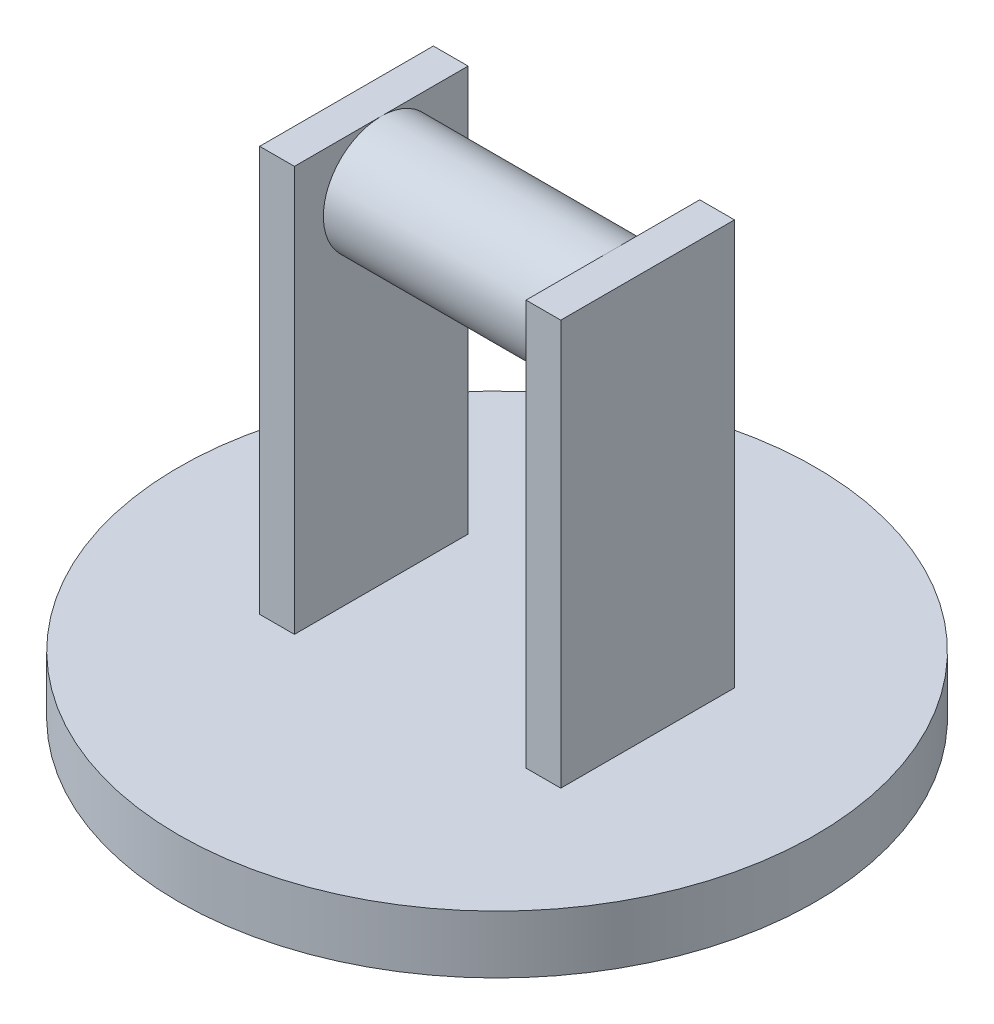
ISO-10303-21;
HEADER;
FILE_DESCRIPTION(('STEP AP214'),'2;1');
FILE_NAME('part.step','',(''),(''),'','','');
FILE_SCHEMA(('AUTOMOTIVE_DESIGN { 1 0 10303 214 1 1 1 1 }'));
ENDSEC;
DATA;
#1=APPLICATION_CONTEXT('core data for automotive mechanical design processes');
#2=APPLICATION_PROTOCOL_DEFINITION('international standard','automotive_design',2000,#1);
#3=PRODUCT_CONTEXT('',#1,'mechanical');
#4=PRODUCT('Part','Part','',(#3));
#5=PRODUCT_RELATED_PRODUCT_CATEGORY('part','',(#4));
#6=PRODUCT_DEFINITION_FORMATION('','',#4);
#7=PRODUCT_DEFINITION_CONTEXT('part definition',#1,'design');
#8=PRODUCT_DEFINITION('design','',#6,#7);
#9=PRODUCT_DEFINITION_SHAPE('','',#8);
#10=(LENGTH_UNIT() NAMED_UNIT(*) SI_UNIT(.MILLI.,.METRE.));
#11=(NAMED_UNIT(*) PLANE_ANGLE_UNIT() SI_UNIT($,.RADIAN.));
#12=(NAMED_UNIT(*) SI_UNIT($,.STERADIAN.) SOLID_ANGLE_UNIT());
#13=UNCERTAINTY_MEASURE_WITH_UNIT(LENGTH_MEASURE(1.E-05),#10,'distance_accuracy_value','');
#14=(GEOMETRIC_REPRESENTATION_CONTEXT(3) GLOBAL_UNCERTAINTY_ASSIGNED_CONTEXT((#13)) GLOBAL_UNIT_ASSIGNED_CONTEXT((#10,
#11,#12)) REPRESENTATION_CONTEXT('',''));
#15=CARTESIAN_POINT('',(0.,0.,0.));
#16=DIRECTION('',(0.,0.,1.));
#17=DIRECTION('',(1.,0.,0.));
#18=AXIS2_PLACEMENT_3D('',#15,#16,#17);
#19=CARTESIAN_POINT('',(0.,6.35,0.));
#20=DIRECTION('',(0.,1.,0.));
#21=DIRECTION('',(0.,0.,1.));
#22=AXIS2_PLACEMENT_3D('',#19,#20,#21);
#23=PLANE('',#22);
#24=DIRECTION('',(0.,0.,1.));
#25=VECTOR('',#24,1.);
#26=CARTESIAN_POINT('',(16.51,6.35,0.));
#27=LINE('',#26,#25);
#28=CARTESIAN_POINT('',(16.51,6.35,-9.525));
#29=VERTEX_POINT('',#28);
#30=CARTESIAN_POINT('',(16.51,6.35,9.525));
#31=VERTEX_POINT('',#30);
#32=EDGE_CURVE('E210',#29,#31,#27,.T.);
#33=ORIENTED_EDGE('',*,*,#32,.T.);
#34=DIRECTION('',(1.,0.,0.));
#35=VECTOR('',#34,1.);
#36=CARTESIAN_POINT('',(0.,6.35,9.525));
#37=LINE('',#36,#35);
#38=CARTESIAN_POINT('',(12.7,6.35,9.525));
#39=VERTEX_POINT('',#38);
#40=EDGE_CURVE('E217',#39,#31,#37,.T.);
#41=ORIENTED_EDGE('',*,*,#40,.F.);
#42=DIRECTION('',(0.,0.,-1.));
#43=VECTOR('',#42,1.);
#44=CARTESIAN_POINT('',(12.7,6.35,0.));
#45=LINE('',#44,#43);
#46=CARTESIAN_POINT('',(12.7,6.35,-9.525));
#47=VERTEX_POINT('',#46);
#48=EDGE_CURVE('E59',#39,#47,#45,.T.);
#49=ORIENTED_EDGE('',*,*,#48,.T.);
#50=DIRECTION('',(1.,0.,0.));
#51=VECTOR('',#50,1.);
#52=CARTESIAN_POINT('',(0.,6.35,-9.525));
#53=LINE('',#52,#51);
#54=EDGE_CURVE('E228',#47,#29,#53,.T.);
#55=ORIENTED_EDGE('',*,*,#54,.T.);
#56=EDGE_LOOP('',(#33,#41,#49,#55));
#57=FACE_BOUND('',#56,.T.);
#58=CARTESIAN_POINT('',(0.,6.35,0.));
#59=DIRECTION('',(0.,1.,0.));
#60=DIRECTION('',(0.,0.,1.));
#61=AXIS2_PLACEMENT_3D('',#58,#59,#60);
#62=CIRCLE('',#61,34.925);
#63=CARTESIAN_POINT('',(0.,6.35,34.925));
#64=VERTEX_POINT('',#63);
#65=EDGE_CURVE('E11',#64,#64,#62,.T.);
#66=ORIENTED_EDGE('',*,*,#65,.T.);
#67=EDGE_LOOP('',(#66));
#68=FACE_BOUND('',#67,.T.);
#69=DIRECTION('',(0.,0.,1.));
#70=VECTOR('',#69,1.);
#71=CARTESIAN_POINT('',(-16.51,6.35,0.));
#72=LINE('',#71,#70);
#73=CARTESIAN_POINT('',(-16.51,6.35,-9.525));
#74=VERTEX_POINT('',#73);
#75=CARTESIAN_POINT('',(-16.51,6.35,9.525));
#76=VERTEX_POINT('',#75);
#77=EDGE_CURVE('E134',#74,#76,#72,.T.);
#78=ORIENTED_EDGE('',*,*,#77,.F.);
#79=DIRECTION('',(-1.,0.,0.));
#80=VECTOR('',#79,1.);
#81=CARTESIAN_POINT('',(0.,6.35,-9.525));
#82=LINE('',#81,#80);
#83=CARTESIAN_POINT('',(-12.7,6.35,-9.525));
#84=VERTEX_POINT('',#83);
#85=EDGE_CURVE('E131',#84,#74,#82,.T.);
#86=ORIENTED_EDGE('',*,*,#85,.F.);
#87=DIRECTION('',(0.,0.,-1.));
#88=VECTOR('',#87,1.);
#89=CARTESIAN_POINT('',(-12.7,6.35,0.));
#90=LINE('',#89,#88);
#91=CARTESIAN_POINT('',(-12.7,6.35,9.525));
#92=VERTEX_POINT('',#91);
#93=EDGE_CURVE('E141',#92,#84,#90,.T.);
#94=ORIENTED_EDGE('',*,*,#93,.F.);
#95=DIRECTION('',(-1.,0.,0.));
#96=VECTOR('',#95,1.);
#97=CARTESIAN_POINT('',(0.,6.35,9.525));
#98=LINE('',#97,#96);
#99=EDGE_CURVE('E138',#92,#76,#98,.T.);
#100=ORIENTED_EDGE('',*,*,#99,.T.);
#101=EDGE_LOOP('',(#78,#86,#94,#100));
#102=FACE_BOUND('',#101,.T.);
#103=ADVANCED_FACE('F39',(#57,#68,#102),#23,.T.);
#104=CARTESIAN_POINT('',(0.,6.35,0.));
#105=DIRECTION('',(0.,-1.,0.));
#106=DIRECTION('',(0.,0.,-1.));
#107=AXIS2_PLACEMENT_3D('',#104,#105,#106);
#108=CYLINDRICAL_SURFACE('',#107,34.925);
#109=ORIENTED_EDGE('',*,*,#65,.F.);
#110=EDGE_LOOP('',(#109));
#111=FACE_BOUND('',#110,.T.);
#112=CARTESIAN_POINT('',(0.,0.,0.));
#113=DIRECTION('',(0.,1.,0.));
#114=DIRECTION('',(0.,0.,1.));
#115=AXIS2_PLACEMENT_3D('',#112,#113,#114);
#116=CIRCLE('',#115,34.925);
#117=CARTESIAN_POINT('',(0.,0.,34.925));
#118=VERTEX_POINT('',#117);
#119=EDGE_CURVE('E43',#118,#118,#116,.T.);
#120=ORIENTED_EDGE('',*,*,#119,.T.);
#121=EDGE_LOOP('',(#120));
#122=FACE_BOUND('',#121,.T.);
#123=ADVANCED_FACE('F41',(#111,#122),#108,.T.);
#124=CARTESIAN_POINT('',(0.,0.,0.));
#125=DIRECTION('',(0.,1.,0.));
#126=DIRECTION('',(0.,0.,1.));
#127=AXIS2_PLACEMENT_3D('',#124,#125,#126);
#128=PLANE('',#127);
#129=ORIENTED_EDGE('',*,*,#119,.F.);
#130=EDGE_LOOP('',(#129));
#131=FACE_BOUND('',#130,.T.);
#132=ADVANCED_FACE('F156',(#131),#128,.F.);
#133=CARTESIAN_POINT('',(0.,50.8,-9.525));
#134=DIRECTION('',(0.,0.,1.));
#135=DIRECTION('',(1.,0.,0.));
#136=AXIS2_PLACEMENT_3D('',#133,#134,#135);
#137=PLANE('',#136);
#138=ORIENTED_EDGE('',*,*,#85,.T.);
#139=DIRECTION('',(0.,-1.,0.));
#140=VECTOR('',#139,1.);
#141=CARTESIAN_POINT('',(-16.51,50.8,-9.525));
#142=LINE('',#141,#140);
#143=CARTESIAN_POINT('',(-16.51,50.8,-9.525));
#144=VERTEX_POINT('',#143);
#145=EDGE_CURVE('E149',#144,#74,#142,.T.);
#146=ORIENTED_EDGE('',*,*,#145,.F.);
#147=DIRECTION('',(-1.,0.,0.));
#148=VECTOR('',#147,1.);
#149=CARTESIAN_POINT('',(0.,50.8,-9.525));
#150=LINE('',#149,#148);
#151=CARTESIAN_POINT('',(-12.7,50.8,-9.525));
#152=VERTEX_POINT('',#151);
#153=EDGE_CURVE('E143',#152,#144,#150,.T.);
#154=ORIENTED_EDGE('',*,*,#153,.F.);
#155=DIRECTION('',(0.,-1.,0.));
#156=VECTOR('',#155,1.);
#157=CARTESIAN_POINT('',(-12.7,50.8,-9.525));
#158=LINE('',#157,#156);
#159=EDGE_CURVE('E120',#152,#84,#158,.T.);
#160=ORIENTED_EDGE('',*,*,#159,.T.);
#161=EDGE_LOOP('',(#138,#146,#154,#160));
#162=FACE_BOUND('',#161,.T.);
#163=ADVANCED_FACE('F158',(#162),#137,.F.);
#164=CARTESIAN_POINT('',(-16.51,50.8,0.));
#165=DIRECTION('',(1.,0.,0.));
#166=DIRECTION('',(0.,0.,-1.));
#167=AXIS2_PLACEMENT_3D('',#164,#165,#166);
#168=PLANE('',#167);
#169=ORIENTED_EDGE('',*,*,#77,.T.);
#170=DIRECTION('',(0.,-1.,0.));
#171=VECTOR('',#170,1.);
#172=CARTESIAN_POINT('',(-16.51,50.8,9.525));
#173=LINE('',#172,#171);
#174=CARTESIAN_POINT('',(-16.51,50.8,9.525));
#175=VERTEX_POINT('',#174);
#176=EDGE_CURVE('E147',#175,#76,#173,.T.);
#177=ORIENTED_EDGE('',*,*,#176,.F.);
#178=DIRECTION('',(0.,0.,1.));
#179=VECTOR('',#178,1.);
#180=CARTESIAN_POINT('',(-16.51,50.8,0.));
#181=LINE('',#180,#179);
#182=EDGE_CURVE('E127',#144,#175,#181,.T.);
#183=ORIENTED_EDGE('',*,*,#182,.F.);
#184=ORIENTED_EDGE('',*,*,#145,.T.);
#185=EDGE_LOOP('',(#169,#177,#183,#184));
#186=FACE_BOUND('',#185,.T.);
#187=ADVANCED_FACE('F163',(#186),#168,.F.);
#188=CARTESIAN_POINT('',(0.,50.8,9.525));
#189=DIRECTION('',(0.,0.,1.));
#190=DIRECTION('',(1.,0.,0.));
#191=AXIS2_PLACEMENT_3D('',#188,#189,#190);
#192=PLANE('',#191);
#193=ORIENTED_EDGE('',*,*,#99,.F.);
#194=DIRECTION('',(0.,-1.,0.));
#195=VECTOR('',#194,1.);
#196=CARTESIAN_POINT('',(-12.7,50.8,9.525));
#197=LINE('',#196,#195);
#198=CARTESIAN_POINT('',(-12.7,50.8,9.525));
#199=VERTEX_POINT('',#198);
#200=EDGE_CURVE('E145',#199,#92,#197,.T.);
#201=ORIENTED_EDGE('',*,*,#200,.F.);
#202=DIRECTION('',(-1.,0.,0.));
#203=VECTOR('',#202,1.);
#204=CARTESIAN_POINT('',(0.,50.8,9.525));
#205=LINE('',#204,#203);
#206=EDGE_CURVE('E116',#199,#175,#205,.T.);
#207=ORIENTED_EDGE('',*,*,#206,.T.);
#208=ORIENTED_EDGE('',*,*,#176,.T.);
#209=EDGE_LOOP('',(#193,#201,#207,#208));
#210=FACE_BOUND('',#209,.T.);
#211=ADVANCED_FACE('F177',(#210),#192,.T.);
#212=CARTESIAN_POINT('',(-12.7,50.8,0.));
#213=DIRECTION('',(-1.,0.,0.));
#214=DIRECTION('',(0.,0.,1.));
#215=AXIS2_PLACEMENT_3D('',#212,#213,#214);
#216=PLANE('',#215);
#217=DIRECTION('',(0.,0.,-1.));
#218=VECTOR('',#217,1.);
#219=CARTESIAN_POINT('',(-12.7,50.8,0.));
#220=LINE('',#219,#218);
#221=CARTESIAN_POINT('',(-12.7,50.8,0.));
#222=VERTEX_POINT('',#221);
#223=EDGE_CURVE('E113',#222,#152,#220,.T.);
#224=ORIENTED_EDGE('',*,*,#223,.F.);
#225=CARTESIAN_POINT('',(-12.7,44.45,0.));
#226=DIRECTION('',(1.,0.,0.));
#227=DIRECTION('',(0.,0.,-1.));
#228=AXIS2_PLACEMENT_3D('',#225,#226,#227);
#229=CIRCLE('',#228,6.35);
#230=EDGE_CURVE('E124',#222,#222,#229,.T.);
#231=ORIENTED_EDGE('',*,*,#230,.F.);
#232=EDGE_CURVE('E109',#199,#222,#220,.T.);
#233=ORIENTED_EDGE('',*,*,#232,.F.);
#234=ORIENTED_EDGE('',*,*,#200,.T.);
#235=ORIENTED_EDGE('',*,*,#93,.T.);
#236=ORIENTED_EDGE('',*,*,#159,.F.);
#237=EDGE_LOOP('',(#224,#231,#233,#234,#235,#236));
#238=FACE_BOUND('',#237,.T.);
#239=ADVANCED_FACE('F122',(#238),#216,.F.);
#240=CARTESIAN_POINT('',(0.,50.8,0.));
#241=DIRECTION('',(0.,1.,0.));
#242=DIRECTION('',(0.,0.,1.));
#243=AXIS2_PLACEMENT_3D('',#240,#241,#242);
#244=PLANE('',#243);
#245=ORIENTED_EDGE('',*,*,#153,.T.);
#246=ORIENTED_EDGE('',*,*,#182,.T.);
#247=ORIENTED_EDGE('',*,*,#206,.F.);
#248=ORIENTED_EDGE('',*,*,#232,.T.);
#249=ORIENTED_EDGE('',*,*,#223,.T.);
#250=EDGE_LOOP('',(#245,#246,#247,#248,#249));
#251=FACE_BOUND('',#250,.T.);
#252=ADVANCED_FACE('F112',(#251),#244,.T.);
#253=CARTESIAN_POINT('',(16.51,50.8,0.));
#254=DIRECTION('',(1.,0.,0.));
#255=DIRECTION('',(0.,0.,-1.));
#256=AXIS2_PLACEMENT_3D('',#253,#254,#255);
#257=PLANE('',#256);
#258=ORIENTED_EDGE('',*,*,#32,.F.);
#259=DIRECTION('',(0.,-1.,0.));
#260=VECTOR('',#259,1.);
#261=CARTESIAN_POINT('',(16.51,50.8,-9.525));
#262=LINE('',#261,#260);
#263=CARTESIAN_POINT('',(16.51,50.8,-9.525));
#264=VERTEX_POINT('',#263);
#265=EDGE_CURVE('E135',#264,#29,#262,.T.);
#266=ORIENTED_EDGE('',*,*,#265,.F.);
#267=DIRECTION('',(0.,0.,1.));
#268=VECTOR('',#267,1.);
#269=CARTESIAN_POINT('',(16.51,50.8,0.));
#270=LINE('',#269,#268);
#271=CARTESIAN_POINT('',(16.51,50.8,9.525));
#272=VERTEX_POINT('',#271);
#273=EDGE_CURVE('E213',#264,#272,#270,.T.);
#274=ORIENTED_EDGE('',*,*,#273,.T.);
#275=DIRECTION('',(0.,-1.,0.));
#276=VECTOR('',#275,1.);
#277=CARTESIAN_POINT('',(16.51,50.8,9.525));
#278=LINE('',#277,#276);
#279=EDGE_CURVE('E226',#272,#31,#278,.T.);
#280=ORIENTED_EDGE('',*,*,#279,.T.);
#281=EDGE_LOOP('',(#258,#266,#274,#280));
#282=FACE_BOUND('',#281,.T.);
#283=ADVANCED_FACE('F185',(#282),#257,.T.);
#284=CARTESIAN_POINT('',(0.,50.8,-9.525));
#285=DIRECTION('',(0.,0.,-1.));
#286=DIRECTION('',(-1.,0.,0.));
#287=AXIS2_PLACEMENT_3D('',#284,#285,#286);
#288=PLANE('',#287);
#289=ORIENTED_EDGE('',*,*,#54,.F.);
#290=DIRECTION('',(0.,-1.,0.));
#291=VECTOR('',#290,1.);
#292=CARTESIAN_POINT('',(12.7,50.8,-9.525));
#293=LINE('',#292,#291);
#294=CARTESIAN_POINT('',(12.7,50.8,-9.525));
#295=VERTEX_POINT('',#294);
#296=EDGE_CURVE('E237',#295,#47,#293,.T.);
#297=ORIENTED_EDGE('',*,*,#296,.F.);
#298=DIRECTION('',(1.,0.,0.));
#299=VECTOR('',#298,1.);
#300=CARTESIAN_POINT('',(0.,50.8,-9.525));
#301=LINE('',#300,#299);
#302=EDGE_CURVE('E216',#295,#264,#301,.T.);
#303=ORIENTED_EDGE('',*,*,#302,.T.);
#304=ORIENTED_EDGE('',*,*,#265,.T.);
#305=EDGE_LOOP('',(#289,#297,#303,#304));
#306=FACE_BOUND('',#305,.T.);
#307=ADVANCED_FACE('F188',(#306),#288,.T.);
#308=CARTESIAN_POINT('',(12.7,50.8,0.));
#309=DIRECTION('',(-1.,0.,0.));
#310=DIRECTION('',(0.,0.,1.));
#311=AXIS2_PLACEMENT_3D('',#308,#309,#310);
#312=PLANE('',#311);
#313=DIRECTION('',(0.,0.,-1.));
#314=VECTOR('',#313,1.);
#315=CARTESIAN_POINT('',(12.7,50.8,0.));
#316=LINE('',#315,#314);
#317=CARTESIAN_POINT('',(12.7,50.8,9.525));
#318=VERTEX_POINT('',#317);
#319=CARTESIAN_POINT('',(12.7,50.8,0.));
#320=VERTEX_POINT('',#319);
#321=EDGE_CURVE('E221',#318,#320,#316,.T.);
#322=ORIENTED_EDGE('',*,*,#321,.T.);
#323=CARTESIAN_POINT('',(12.7,44.45,0.));
#324=DIRECTION('',(-1.,0.,0.));
#325=DIRECTION('',(0.,0.,1.));
#326=AXIS2_PLACEMENT_3D('',#323,#324,#325);
#327=CIRCLE('',#326,6.35);
#328=EDGE_CURVE('E52',#320,#320,#327,.T.);
#329=ORIENTED_EDGE('',*,*,#328,.F.);
#330=EDGE_CURVE('E220',#320,#295,#316,.T.);
#331=ORIENTED_EDGE('',*,*,#330,.T.);
#332=ORIENTED_EDGE('',*,*,#296,.T.);
#333=ORIENTED_EDGE('',*,*,#48,.F.);
#334=DIRECTION('',(0.,-1.,0.));
#335=VECTOR('',#334,1.);
#336=CARTESIAN_POINT('',(12.7,50.8,9.525));
#337=LINE('',#336,#335);
#338=EDGE_CURVE('E235',#318,#39,#337,.T.);
#339=ORIENTED_EDGE('',*,*,#338,.F.);
#340=EDGE_LOOP('',(#322,#329,#331,#332,#333,#339));
#341=FACE_BOUND('',#340,.T.);
#342=ADVANCED_FACE('F192',(#341),#312,.T.);
#343=CARTESIAN_POINT('',(0.,50.8,9.525));
#344=DIRECTION('',(0.,0.,-1.));
#345=DIRECTION('',(-1.,0.,0.));
#346=AXIS2_PLACEMENT_3D('',#343,#344,#345);
#347=PLANE('',#346);
#348=ORIENTED_EDGE('',*,*,#40,.T.);
#349=ORIENTED_EDGE('',*,*,#279,.F.);
#350=DIRECTION('',(1.,0.,0.));
#351=VECTOR('',#350,1.);
#352=CARTESIAN_POINT('',(0.,50.8,9.525));
#353=LINE('',#352,#351);
#354=EDGE_CURVE('E224',#318,#272,#353,.T.);
#355=ORIENTED_EDGE('',*,*,#354,.F.);
#356=ORIENTED_EDGE('',*,*,#338,.T.);
#357=EDGE_LOOP('',(#348,#349,#355,#356));
#358=FACE_BOUND('',#357,.T.);
#359=ADVANCED_FACE('F196',(#358),#347,.F.);
#360=CARTESIAN_POINT('',(0.,50.8,0.));
#361=DIRECTION('',(0.,1.,0.));
#362=DIRECTION('',(0.,0.,1.));
#363=AXIS2_PLACEMENT_3D('',#360,#361,#362);
#364=PLANE('',#363);
#365=ORIENTED_EDGE('',*,*,#273,.F.);
#366=ORIENTED_EDGE('',*,*,#302,.F.);
#367=ORIENTED_EDGE('',*,*,#330,.F.);
#368=ORIENTED_EDGE('',*,*,#321,.F.);
#369=ORIENTED_EDGE('',*,*,#354,.T.);
#370=EDGE_LOOP('',(#365,#366,#367,#368,#369));
#371=FACE_BOUND('',#370,.T.);
#372=ADVANCED_FACE('F199',(#371),#364,.T.);
#373=CARTESIAN_POINT('',(30.6605122421383,44.45,0.));
#374=DIRECTION('',(-1.,0.,0.));
#375=DIRECTION('',(0.,0.,1.));
#376=AXIS2_PLACEMENT_3D('',#373,#374,#375);
#377=CYLINDRICAL_SURFACE('',#376,6.35);
#378=ORIENTED_EDGE('',*,*,#328,.T.);
#379=EDGE_LOOP('',(#378));
#380=FACE_BOUND('',#379,.T.);
#381=ORIENTED_EDGE('',*,*,#230,.T.);
#382=EDGE_LOOP('',(#381));
#383=FACE_BOUND('',#382,.T.);
#384=ADVANCED_FACE('F203',(#380,#383),#377,.T.);
#385=CLOSED_SHELL('',(#103,#123,#132,#163,#187,#211,#239,#252,#283,#307,#342,#359,#372,#384));
#386=MANIFOLD_SOLID_BREP('B2',#385);
#387=ADVANCED_BREP_SHAPE_REPRESENTATION('',(#18,#386),#14);
#388=SHAPE_DEFINITION_REPRESENTATION(#9,#387);
ENDSEC;
END-ISO-10303-21;
